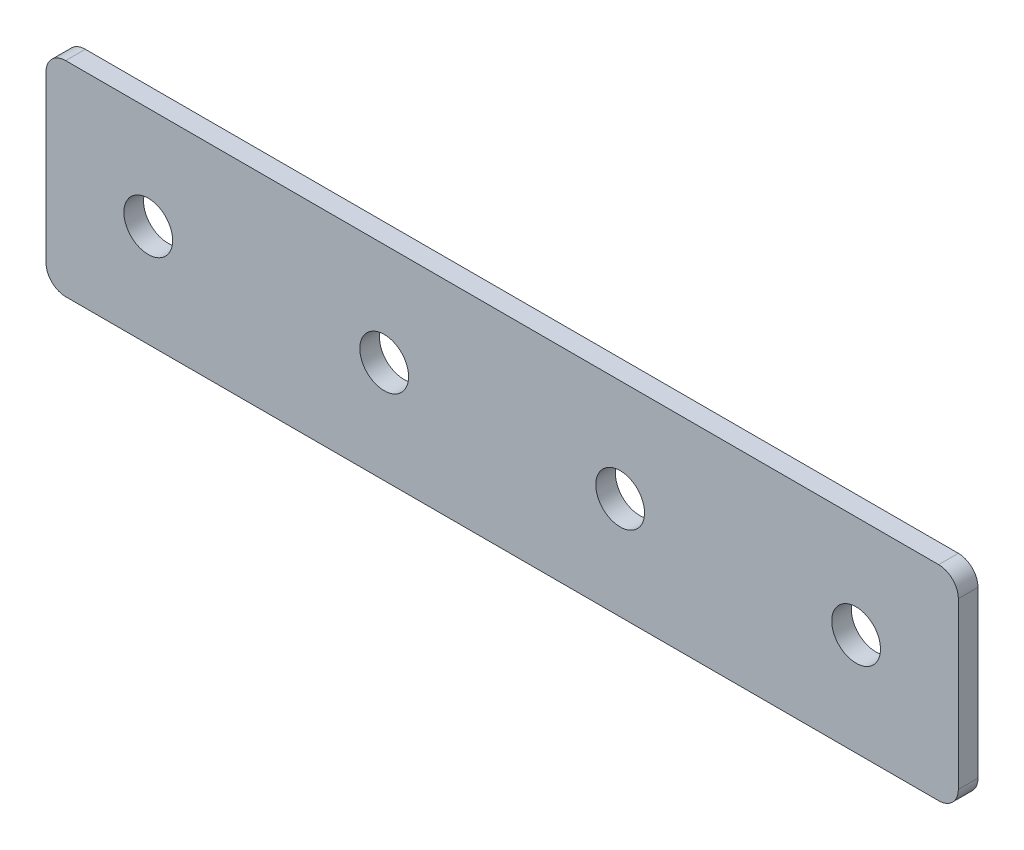
ISO-10303-21;
HEADER;
FILE_DESCRIPTION(('STEP AP214'),'2;1');
FILE_NAME('part.step','',(''),(''),'','','');
FILE_SCHEMA(('AUTOMOTIVE_DESIGN { 1 0 10303 214 1 1 1 1 }'));
ENDSEC;
DATA;
#1=APPLICATION_CONTEXT('core data for automotive mechanical design processes');
#2=APPLICATION_PROTOCOL_DEFINITION('international standard','automotive_design',2000,#1);
#3=PRODUCT_CONTEXT('',#1,'mechanical');
#4=PRODUCT('Part','Part','',(#3));
#5=PRODUCT_RELATED_PRODUCT_CATEGORY('part','',(#4));
#6=PRODUCT_DEFINITION_FORMATION('','',#4);
#7=PRODUCT_DEFINITION_CONTEXT('part definition',#1,'design');
#8=PRODUCT_DEFINITION('design','',#6,#7);
#9=PRODUCT_DEFINITION_SHAPE('','',#8);
#10=(LENGTH_UNIT() NAMED_UNIT(*) SI_UNIT(.MILLI.,.METRE.));
#11=(NAMED_UNIT(*) PLANE_ANGLE_UNIT() SI_UNIT($,.RADIAN.));
#12=(NAMED_UNIT(*) SI_UNIT($,.STERADIAN.) SOLID_ANGLE_UNIT());
#13=UNCERTAINTY_MEASURE_WITH_UNIT(LENGTH_MEASURE(1.E-05),#10,'distance_accuracy_value','');
#14=(GEOMETRIC_REPRESENTATION_CONTEXT(3) GLOBAL_UNCERTAINTY_ASSIGNED_CONTEXT((#13)) GLOBAL_UNIT_ASSIGNED_CONTEXT((#10,
#11,#12)) REPRESENTATION_CONTEXT('',''));
#15=CARTESIAN_POINT('',(0.,0.,0.));
#16=DIRECTION('',(0.,0.,1.));
#17=DIRECTION('',(1.,0.,0.));
#18=AXIS2_PLACEMENT_3D('',#15,#16,#17);
#19=CARTESIAN_POINT('',(0.,0.,2.5));
#20=DIRECTION('',(0.,0.,-1.));
#21=DIRECTION('',(-1.,0.,0.));
#22=AXIS2_PLACEMENT_3D('',#19,#20,#21);
#23=PLANE('',#22);
#24=CARTESIAN_POINT('',(90.,0.,2.5));
#25=DIRECTION('',(0.,0.,1.));
#26=DIRECTION('',(1.,0.,0.));
#27=AXIS2_PLACEMENT_3D('',#24,#25,#26);
#28=CIRCLE('',#27,3.1);
#29=CARTESIAN_POINT('',(93.1,0.,2.5));
#30=VERTEX_POINT('',#29);
#31=EDGE_CURVE('E154',#30,#30,#28,.T.);
#32=ORIENTED_EDGE('',*,*,#31,.F.);
#33=EDGE_LOOP('',(#32));
#34=FACE_BOUND('',#33,.T.);
#35=CARTESIAN_POINT('',(60.,0.,2.5));
#36=DIRECTION('',(0.,0.,1.));
#37=DIRECTION('',(1.,0.,0.));
#38=AXIS2_PLACEMENT_3D('',#35,#36,#37);
#39=CIRCLE('',#38,3.1);
#40=CARTESIAN_POINT('',(63.1,0.,2.5));
#41=VERTEX_POINT('',#40);
#42=EDGE_CURVE('E160',#41,#41,#39,.T.);
#43=ORIENTED_EDGE('',*,*,#42,.F.);
#44=EDGE_LOOP('',(#43));
#45=FACE_BOUND('',#44,.T.);
#46=CARTESIAN_POINT('',(30.,0.,2.5));
#47=DIRECTION('',(0.,0.,1.));
#48=DIRECTION('',(1.,0.,0.));
#49=AXIS2_PLACEMENT_3D('',#46,#47,#48);
#50=CIRCLE('',#49,3.1);
#51=CARTESIAN_POINT('',(33.1,0.,2.5));
#52=VERTEX_POINT('',#51);
#53=EDGE_CURVE('E166',#52,#52,#50,.T.);
#54=ORIENTED_EDGE('',*,*,#53,.F.);
#55=EDGE_LOOP('',(#54));
#56=FACE_BOUND('',#55,.T.);
#57=CARTESIAN_POINT('',(0.,0.,2.5));
#58=DIRECTION('',(0.,0.,1.));
#59=DIRECTION('',(1.,0.,0.));
#60=AXIS2_PLACEMENT_3D('',#57,#58,#59);
#61=CIRCLE('',#60,3.1);
#62=CARTESIAN_POINT('',(3.1,0.,2.5));
#63=VERTEX_POINT('',#62);
#64=EDGE_CURVE('E107',#63,#63,#61,.T.);
#65=ORIENTED_EDGE('',*,*,#64,.F.);
#66=EDGE_LOOP('',(#65));
#67=FACE_BOUND('',#66,.T.);
#68=DIRECTION('',(1.,0.,0.));
#69=VECTOR('',#68,1.);
#70=CARTESIAN_POINT('',(-13.,-13.,2.5));
#71=LINE('',#70,#69);
#72=CARTESIAN_POINT('',(-10.5,-13.,2.5));
#73=VERTEX_POINT('',#72);
#74=CARTESIAN_POINT('',(100.5,-13.,2.5));
#75=VERTEX_POINT('',#74);
#76=EDGE_CURVE('E84',#73,#75,#71,.T.);
#77=ORIENTED_EDGE('',*,*,#76,.T.);
#78=CARTESIAN_POINT('',(100.5,-10.5,2.5));
#79=DIRECTION('',(0.,0.,-1.));
#80=DIRECTION('',(-1.,0.,0.));
#81=AXIS2_PLACEMENT_3D('',#78,#79,#80);
#82=CIRCLE('',#81,2.5);
#83=CARTESIAN_POINT('',(103.,-10.5,2.5));
#84=VERTEX_POINT('',#83);
#85=EDGE_CURVE('E91',#75,#84,#82,.F.);
#86=ORIENTED_EDGE('',*,*,#85,.T.);
#87=DIRECTION('',(0.,1.,0.));
#88=VECTOR('',#87,1.);
#89=CARTESIAN_POINT('',(103.,-13.,2.5));
#90=LINE('',#89,#88);
#91=CARTESIAN_POINT('',(103.,10.5,2.5));
#92=VERTEX_POINT('',#91);
#93=EDGE_CURVE('E102',#84,#92,#90,.T.);
#94=ORIENTED_EDGE('',*,*,#93,.T.);
#95=CARTESIAN_POINT('',(100.5,10.5,2.5));
#96=DIRECTION('',(0.,0.,-1.));
#97=DIRECTION('',(-1.,0.,0.));
#98=AXIS2_PLACEMENT_3D('',#95,#96,#97);
#99=CIRCLE('',#98,2.5);
#100=CARTESIAN_POINT('',(100.5,13.,2.5));
#101=VERTEX_POINT('',#100);
#102=EDGE_CURVE('E109',#92,#101,#99,.F.);
#103=ORIENTED_EDGE('',*,*,#102,.T.);
#104=DIRECTION('',(-1.,0.,0.));
#105=VECTOR('',#104,1.);
#106=CARTESIAN_POINT('',(103.,13.,2.5));
#107=LINE('',#106,#105);
#108=CARTESIAN_POINT('',(-10.5,13.,2.5));
#109=VERTEX_POINT('',#108);
#110=EDGE_CURVE('E139',#101,#109,#107,.T.);
#111=ORIENTED_EDGE('',*,*,#110,.T.);
#112=CARTESIAN_POINT('',(-10.5,10.5,2.5));
#113=DIRECTION('',(0.,0.,-1.));
#114=DIRECTION('',(-1.,0.,0.));
#115=AXIS2_PLACEMENT_3D('',#112,#113,#114);
#116=CIRCLE('',#115,2.5);
#117=CARTESIAN_POINT('',(-13.,10.5,2.5));
#118=VERTEX_POINT('',#117);
#119=EDGE_CURVE('E92',#109,#118,#116,.F.);
#120=ORIENTED_EDGE('',*,*,#119,.T.);
#121=DIRECTION('',(0.,-1.,0.));
#122=VECTOR('',#121,1.);
#123=CARTESIAN_POINT('',(-13.,13.,2.5));
#124=LINE('',#123,#122);
#125=CARTESIAN_POINT('',(-13.,-10.5,2.5));
#126=VERTEX_POINT('',#125);
#127=EDGE_CURVE('E86',#118,#126,#124,.T.);
#128=ORIENTED_EDGE('',*,*,#127,.T.);
#129=CARTESIAN_POINT('',(-10.5,-10.5,2.5));
#130=DIRECTION('',(0.,0.,-1.));
#131=DIRECTION('',(-1.,0.,0.));
#132=AXIS2_PLACEMENT_3D('',#129,#130,#131);
#133=CIRCLE('',#132,2.5);
#134=EDGE_CURVE('E82',#126,#73,#133,.F.);
#135=ORIENTED_EDGE('',*,*,#134,.T.);
#136=EDGE_LOOP('',(#77,#86,#94,#103,#111,#120,#128,#135));
#137=FACE_BOUND('',#136,.T.);
#138=ADVANCED_FACE('F16',(#34,#45,#56,#67,#137),#23,.F.);
#139=CARTESIAN_POINT('',(0.,0.,0.));
#140=DIRECTION('',(0.,0.,-1.));
#141=DIRECTION('',(-1.,0.,0.));
#142=AXIS2_PLACEMENT_3D('',#139,#140,#141);
#143=PLANE('',#142);
#144=CARTESIAN_POINT('',(90.,0.,0.));
#145=DIRECTION('',(0.,0.,1.));
#146=DIRECTION('',(1.,0.,0.));
#147=AXIS2_PLACEMENT_3D('',#144,#145,#146);
#148=CIRCLE('',#147,3.1);
#149=CARTESIAN_POINT('',(93.1,0.,0.));
#150=VERTEX_POINT('',#149);
#151=EDGE_CURVE('E150',#150,#150,#148,.T.);
#152=ORIENTED_EDGE('',*,*,#151,.T.);
#153=EDGE_LOOP('',(#152));
#154=FACE_BOUND('',#153,.T.);
#155=CARTESIAN_POINT('',(60.,0.,0.));
#156=DIRECTION('',(0.,0.,1.));
#157=DIRECTION('',(1.,0.,0.));
#158=AXIS2_PLACEMENT_3D('',#155,#156,#157);
#159=CIRCLE('',#158,3.1);
#160=CARTESIAN_POINT('',(63.1,0.,0.));
#161=VERTEX_POINT('',#160);
#162=EDGE_CURVE('E157',#161,#161,#159,.T.);
#163=ORIENTED_EDGE('',*,*,#162,.T.);
#164=EDGE_LOOP('',(#163));
#165=FACE_BOUND('',#164,.T.);
#166=CARTESIAN_POINT('',(30.,0.,0.));
#167=DIRECTION('',(0.,0.,1.));
#168=DIRECTION('',(1.,0.,0.));
#169=AXIS2_PLACEMENT_3D('',#166,#167,#168);
#170=CIRCLE('',#169,3.1);
#171=CARTESIAN_POINT('',(33.1,0.,0.));
#172=VERTEX_POINT('',#171);
#173=EDGE_CURVE('E163',#172,#172,#170,.T.);
#174=ORIENTED_EDGE('',*,*,#173,.T.);
#175=EDGE_LOOP('',(#174));
#176=FACE_BOUND('',#175,.T.);
#177=CARTESIAN_POINT('',(0.,0.,0.));
#178=DIRECTION('',(0.,0.,1.));
#179=DIRECTION('',(1.,0.,0.));
#180=AXIS2_PLACEMENT_3D('',#177,#178,#179);
#181=CIRCLE('',#180,3.1);
#182=CARTESIAN_POINT('',(3.1,0.,0.));
#183=VERTEX_POINT('',#182);
#184=EDGE_CURVE('E112',#183,#183,#181,.T.);
#185=ORIENTED_EDGE('',*,*,#184,.T.);
#186=EDGE_LOOP('',(#185));
#187=FACE_BOUND('',#186,.T.);
#188=DIRECTION('',(0.,1.,0.));
#189=VECTOR('',#188,1.);
#190=CARTESIAN_POINT('',(103.,-13.,0.));
#191=LINE('',#190,#189);
#192=CARTESIAN_POINT('',(103.,-10.5,0.));
#193=VERTEX_POINT('',#192);
#194=CARTESIAN_POINT('',(103.,10.5,0.));
#195=VERTEX_POINT('',#194);
#196=EDGE_CURVE('E141',#193,#195,#191,.T.);
#197=ORIENTED_EDGE('',*,*,#196,.F.);
#198=CARTESIAN_POINT('',(100.5,-10.5,0.));
#199=DIRECTION('',(0.,0.,-1.));
#200=DIRECTION('',(-1.,0.,0.));
#201=AXIS2_PLACEMENT_3D('',#198,#199,#200);
#202=CIRCLE('',#201,2.5);
#203=CARTESIAN_POINT('',(100.5,-13.,0.));
#204=VERTEX_POINT('',#203);
#205=EDGE_CURVE('E128',#193,#204,#202,.T.);
#206=ORIENTED_EDGE('',*,*,#205,.T.);
#207=DIRECTION('',(1.,0.,0.));
#208=VECTOR('',#207,1.);
#209=CARTESIAN_POINT('',(-13.,-13.,0.));
#210=LINE('',#209,#208);
#211=CARTESIAN_POINT('',(-10.5,-13.,0.));
#212=VERTEX_POINT('',#211);
#213=EDGE_CURVE('E138',#212,#204,#210,.T.);
#214=ORIENTED_EDGE('',*,*,#213,.F.);
#215=CARTESIAN_POINT('',(-10.5,-10.5,0.));
#216=DIRECTION('',(0.,0.,-1.));
#217=DIRECTION('',(-1.,0.,0.));
#218=AXIS2_PLACEMENT_3D('',#215,#216,#217);
#219=CIRCLE('',#218,2.5);
#220=CARTESIAN_POINT('',(-13.,-10.5,0.));
#221=VERTEX_POINT('',#220);
#222=EDGE_CURVE('E106',#212,#221,#219,.T.);
#223=ORIENTED_EDGE('',*,*,#222,.T.);
#224=DIRECTION('',(0.,-1.,0.));
#225=VECTOR('',#224,1.);
#226=CARTESIAN_POINT('',(-13.,13.,0.));
#227=LINE('',#226,#225);
#228=CARTESIAN_POINT('',(-13.,10.5,0.));
#229=VERTEX_POINT('',#228);
#230=EDGE_CURVE('E137',#229,#221,#227,.T.);
#231=ORIENTED_EDGE('',*,*,#230,.F.);
#232=CARTESIAN_POINT('',(-10.5,10.5,0.));
#233=DIRECTION('',(0.,0.,-1.));
#234=DIRECTION('',(-1.,0.,0.));
#235=AXIS2_PLACEMENT_3D('',#232,#233,#234);
#236=CIRCLE('',#235,2.5);
#237=CARTESIAN_POINT('',(-10.5,13.,0.));
#238=VERTEX_POINT('',#237);
#239=EDGE_CURVE('E31',#229,#238,#236,.T.);
#240=ORIENTED_EDGE('',*,*,#239,.T.);
#241=DIRECTION('',(-1.,0.,0.));
#242=VECTOR('',#241,1.);
#243=CARTESIAN_POINT('',(103.,13.,0.));
#244=LINE('',#243,#242);
#245=CARTESIAN_POINT('',(100.5,13.,0.));
#246=VERTEX_POINT('',#245);
#247=EDGE_CURVE('E148',#246,#238,#244,.T.);
#248=ORIENTED_EDGE('',*,*,#247,.F.);
#249=CARTESIAN_POINT('',(100.5,10.5,0.));
#250=DIRECTION('',(0.,0.,-1.));
#251=DIRECTION('',(-1.,0.,0.));
#252=AXIS2_PLACEMENT_3D('',#249,#250,#251);
#253=CIRCLE('',#252,2.5);
#254=EDGE_CURVE('E124',#246,#195,#253,.T.);
#255=ORIENTED_EDGE('',*,*,#254,.T.);
#256=EDGE_LOOP('',(#197,#206,#214,#223,#231,#240,#248,#255));
#257=FACE_BOUND('',#256,.T.);
#258=ADVANCED_FACE('F172',(#154,#165,#176,#187,#257),#143,.T.);
#259=CARTESIAN_POINT('',(0.,0.,2.5));
#260=DIRECTION('',(0.,0.,-1.));
#261=DIRECTION('',(-1.,0.,0.));
#262=AXIS2_PLACEMENT_3D('',#259,#260,#261);
#263=CYLINDRICAL_SURFACE('',#262,3.1);
#264=ORIENTED_EDGE('',*,*,#64,.T.);
#265=EDGE_LOOP('',(#264));
#266=FACE_BOUND('',#265,.T.);
#267=ORIENTED_EDGE('',*,*,#184,.F.);
#268=EDGE_LOOP('',(#267));
#269=FACE_BOUND('',#268,.T.);
#270=ADVANCED_FACE('F178',(#266,#269),#263,.F.);
#271=CARTESIAN_POINT('',(30.,0.,2.5));
#272=DIRECTION('',(0.,0.,-1.));
#273=DIRECTION('',(-1.,0.,0.));
#274=AXIS2_PLACEMENT_3D('',#271,#272,#273);
#275=CYLINDRICAL_SURFACE('',#274,3.1);
#276=ORIENTED_EDGE('',*,*,#53,.T.);
#277=EDGE_LOOP('',(#276));
#278=FACE_BOUND('',#277,.T.);
#279=ORIENTED_EDGE('',*,*,#173,.F.);
#280=EDGE_LOOP('',(#279));
#281=FACE_BOUND('',#280,.T.);
#282=ADVANCED_FACE('F175',(#278,#281),#275,.F.);
#283=CARTESIAN_POINT('',(60.,0.,2.5));
#284=DIRECTION('',(0.,0.,-1.));
#285=DIRECTION('',(-1.,0.,0.));
#286=AXIS2_PLACEMENT_3D('',#283,#284,#285);
#287=CYLINDRICAL_SURFACE('',#286,3.1);
#288=ORIENTED_EDGE('',*,*,#42,.T.);
#289=EDGE_LOOP('',(#288));
#290=FACE_BOUND('',#289,.T.);
#291=ORIENTED_EDGE('',*,*,#162,.F.);
#292=EDGE_LOOP('',(#291));
#293=FACE_BOUND('',#292,.T.);
#294=ADVANCED_FACE('F177',(#290,#293),#287,.F.);
#295=CARTESIAN_POINT('',(90.,0.,2.5));
#296=DIRECTION('',(0.,0.,-1.));
#297=DIRECTION('',(-1.,0.,0.));
#298=AXIS2_PLACEMENT_3D('',#295,#296,#297);
#299=CYLINDRICAL_SURFACE('',#298,3.1);
#300=ORIENTED_EDGE('',*,*,#31,.T.);
#301=EDGE_LOOP('',(#300));
#302=FACE_BOUND('',#301,.T.);
#303=ORIENTED_EDGE('',*,*,#151,.F.);
#304=EDGE_LOOP('',(#303));
#305=FACE_BOUND('',#304,.T.);
#306=ADVANCED_FACE('F186',(#302,#305),#299,.F.);
#307=CARTESIAN_POINT('',(-13.,13.,0.));
#308=DIRECTION('',(-1.,0.,0.));
#309=DIRECTION('',(0.,0.,1.));
#310=AXIS2_PLACEMENT_3D('',#307,#308,#309);
#311=PLANE('',#310);
#312=ORIENTED_EDGE('',*,*,#230,.T.);
#313=DIRECTION('',(0.,0.,1.));
#314=VECTOR('',#313,1.);
#315=CARTESIAN_POINT('',(-13.,-10.5,0.));
#316=LINE('',#315,#314);
#317=EDGE_CURVE('E132',#221,#126,#316,.T.);
#318=ORIENTED_EDGE('',*,*,#317,.T.);
#319=ORIENTED_EDGE('',*,*,#127,.F.);
#320=DIRECTION('',(0.,0.,1.));
#321=VECTOR('',#320,1.);
#322=CARTESIAN_POINT('',(-13.,10.5,0.));
#323=LINE('',#322,#321);
#324=EDGE_CURVE('E130',#118,#229,#323,.F.);
#325=ORIENTED_EDGE('',*,*,#324,.T.);
#326=EDGE_LOOP('',(#312,#318,#319,#325));
#327=FACE_BOUND('',#326,.T.);
#328=ADVANCED_FACE('F135',(#327),#311,.T.);
#329=CARTESIAN_POINT('',(103.,13.,0.));
#330=DIRECTION('',(0.,1.,0.));
#331=DIRECTION('',(0.,0.,1.));
#332=AXIS2_PLACEMENT_3D('',#329,#330,#331);
#333=PLANE('',#332);
#334=ORIENTED_EDGE('',*,*,#247,.T.);
#335=DIRECTION('',(0.,0.,1.));
#336=VECTOR('',#335,1.);
#337=CARTESIAN_POINT('',(-10.5,13.,0.));
#338=LINE('',#337,#336);
#339=EDGE_CURVE('E10',#238,#109,#338,.T.);
#340=ORIENTED_EDGE('',*,*,#339,.T.);
#341=ORIENTED_EDGE('',*,*,#110,.F.);
#342=DIRECTION('',(0.,0.,1.));
#343=VECTOR('',#342,1.);
#344=CARTESIAN_POINT('',(100.5,13.,0.));
#345=LINE('',#344,#343);
#346=EDGE_CURVE('E24',#101,#246,#345,.F.);
#347=ORIENTED_EDGE('',*,*,#346,.T.);
#348=EDGE_LOOP('',(#334,#340,#341,#347));
#349=FACE_BOUND('',#348,.T.);
#350=ADVANCED_FACE('F215',(#349),#333,.T.);
#351=CARTESIAN_POINT('',(103.,-13.,0.));
#352=DIRECTION('',(1.,0.,0.));
#353=DIRECTION('',(0.,0.,-1.));
#354=AXIS2_PLACEMENT_3D('',#351,#352,#353);
#355=PLANE('',#354);
#356=ORIENTED_EDGE('',*,*,#93,.F.);
#357=DIRECTION('',(0.,0.,1.));
#358=VECTOR('',#357,1.);
#359=CARTESIAN_POINT('',(103.,-10.5,0.));
#360=LINE('',#359,#358);
#361=EDGE_CURVE('E122',#84,#193,#360,.F.);
#362=ORIENTED_EDGE('',*,*,#361,.T.);
#363=ORIENTED_EDGE('',*,*,#196,.T.);
#364=DIRECTION('',(0.,0.,1.));
#365=VECTOR('',#364,1.);
#366=CARTESIAN_POINT('',(103.,10.5,0.));
#367=LINE('',#366,#365);
#368=EDGE_CURVE('E119',#195,#92,#367,.T.);
#369=ORIENTED_EDGE('',*,*,#368,.T.);
#370=EDGE_LOOP('',(#356,#362,#363,#369));
#371=FACE_BOUND('',#370,.T.);
#372=ADVANCED_FACE('F220',(#371),#355,.T.);
#373=CARTESIAN_POINT('',(-13.,-13.,0.));
#374=DIRECTION('',(0.,-1.,0.));
#375=DIRECTION('',(0.,0.,-1.));
#376=AXIS2_PLACEMENT_3D('',#373,#374,#375);
#377=PLANE('',#376);
#378=ORIENTED_EDGE('',*,*,#213,.T.);
#379=DIRECTION('',(0.,0.,1.));
#380=VECTOR('',#379,1.);
#381=CARTESIAN_POINT('',(100.5,-13.,0.));
#382=LINE('',#381,#380);
#383=EDGE_CURVE('E101',#204,#75,#382,.T.);
#384=ORIENTED_EDGE('',*,*,#383,.T.);
#385=ORIENTED_EDGE('',*,*,#76,.F.);
#386=DIRECTION('',(0.,0.,1.));
#387=VECTOR('',#386,1.);
#388=CARTESIAN_POINT('',(-10.5,-13.,0.));
#389=LINE('',#388,#387);
#390=EDGE_CURVE('E98',#73,#212,#389,.F.);
#391=ORIENTED_EDGE('',*,*,#390,.T.);
#392=EDGE_LOOP('',(#378,#384,#385,#391));
#393=FACE_BOUND('',#392,.T.);
#394=ADVANCED_FACE('F97',(#393),#377,.T.);
#395=CARTESIAN_POINT('',(100.5,-10.5,0.));
#396=DIRECTION('',(0.,0.,1.));
#397=DIRECTION('',(1.,0.,0.));
#398=AXIS2_PLACEMENT_3D('',#395,#396,#397);
#399=CYLINDRICAL_SURFACE('',#398,2.5);
#400=ORIENTED_EDGE('',*,*,#205,.F.);
#401=ORIENTED_EDGE('',*,*,#361,.F.);
#402=ORIENTED_EDGE('',*,*,#85,.F.);
#403=ORIENTED_EDGE('',*,*,#383,.F.);
#404=EDGE_LOOP('',(#400,#401,#402,#403));
#405=FACE_BOUND('',#404,.T.);
#406=ADVANCED_FACE('F202',(#405),#399,.T.);
#407=CARTESIAN_POINT('',(-10.5,-10.5,0.));
#408=DIRECTION('',(0.,0.,1.));
#409=DIRECTION('',(1.,0.,0.));
#410=AXIS2_PLACEMENT_3D('',#407,#408,#409);
#411=CYLINDRICAL_SURFACE('',#410,2.5);
#412=ORIENTED_EDGE('',*,*,#222,.F.);
#413=ORIENTED_EDGE('',*,*,#390,.F.);
#414=ORIENTED_EDGE('',*,*,#134,.F.);
#415=ORIENTED_EDGE('',*,*,#317,.F.);
#416=EDGE_LOOP('',(#412,#413,#414,#415));
#417=FACE_BOUND('',#416,.T.);
#418=ADVANCED_FACE('F105',(#417),#411,.T.);
#419=CARTESIAN_POINT('',(-10.5,10.5,0.));
#420=DIRECTION('',(0.,0.,1.));
#421=DIRECTION('',(1.,0.,0.));
#422=AXIS2_PLACEMENT_3D('',#419,#420,#421);
#423=CYLINDRICAL_SURFACE('',#422,2.5);
#424=ORIENTED_EDGE('',*,*,#239,.F.);
#425=ORIENTED_EDGE('',*,*,#324,.F.);
#426=ORIENTED_EDGE('',*,*,#119,.F.);
#427=ORIENTED_EDGE('',*,*,#339,.F.);
#428=EDGE_LOOP('',(#424,#425,#426,#427));
#429=FACE_BOUND('',#428,.T.);
#430=ADVANCED_FACE('F207',(#429),#423,.T.);
#431=CARTESIAN_POINT('',(100.5,10.5,0.));
#432=DIRECTION('',(0.,0.,1.));
#433=DIRECTION('',(1.,0.,0.));
#434=AXIS2_PLACEMENT_3D('',#431,#432,#433);
#435=CYLINDRICAL_SURFACE('',#434,2.5);
#436=ORIENTED_EDGE('',*,*,#254,.F.);
#437=ORIENTED_EDGE('',*,*,#346,.F.);
#438=ORIENTED_EDGE('',*,*,#102,.F.);
#439=ORIENTED_EDGE('',*,*,#368,.F.);
#440=EDGE_LOOP('',(#436,#437,#438,#439));
#441=FACE_BOUND('',#440,.T.);
#442=ADVANCED_FACE('F18',(#441),#435,.T.);
#443=CLOSED_SHELL('',(#138,#258,#270,#282,#294,#306,#328,#350,#372,#394,#406,#418,#430,#442));
#444=MANIFOLD_SOLID_BREP('B1',#443);
#445=ADVANCED_BREP_SHAPE_REPRESENTATION('',(#18,#444),#14);
#446=SHAPE_DEFINITION_REPRESENTATION(#9,#445);
ENDSEC;
END-ISO-10303-21;
